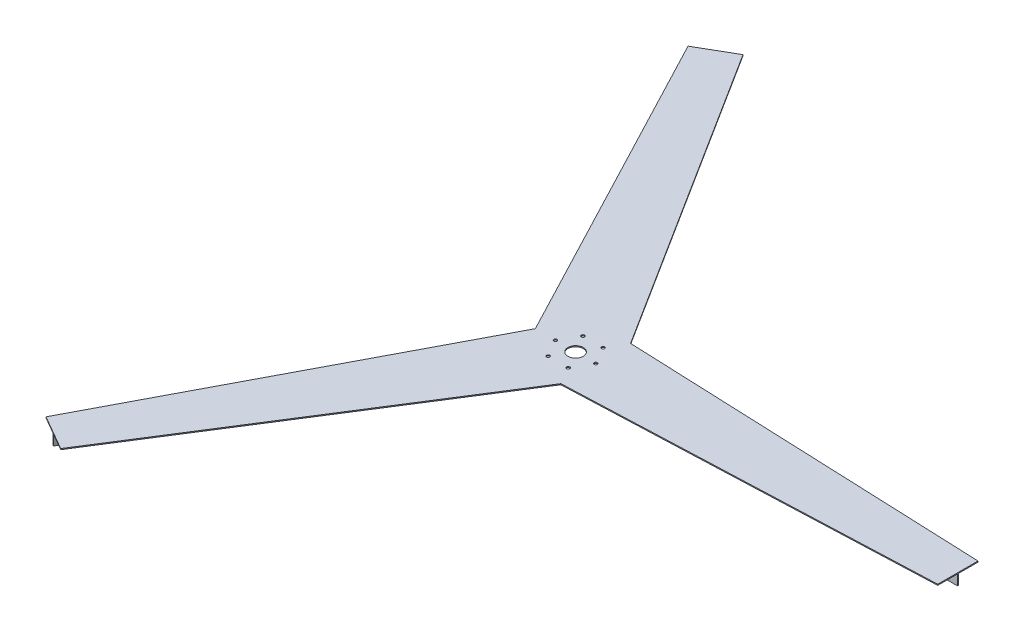
ISO-10303-21;
HEADER;
FILE_DESCRIPTION(('STEP AP214'),'2;1');
FILE_NAME('part.step','',(''),(''),'','','');
FILE_SCHEMA(('AUTOMOTIVE_DESIGN { 1 0 10303 214 1 1 1 1 }'));
ENDSEC;
DATA;
#1=APPLICATION_CONTEXT('core data for automotive mechanical design processes');
#2=APPLICATION_PROTOCOL_DEFINITION('international standard','automotive_design',2000,#1);
#3=PRODUCT_CONTEXT('',#1,'mechanical');
#4=PRODUCT('Part','Part','',(#3));
#5=PRODUCT_RELATED_PRODUCT_CATEGORY('part','',(#4));
#6=PRODUCT_DEFINITION_FORMATION('','',#4);
#7=PRODUCT_DEFINITION_CONTEXT('part definition',#1,'design');
#8=PRODUCT_DEFINITION('design','',#6,#7);
#9=PRODUCT_DEFINITION_SHAPE('','',#8);
#10=(LENGTH_UNIT() NAMED_UNIT(*) SI_UNIT(.MILLI.,.METRE.));
#11=(NAMED_UNIT(*) PLANE_ANGLE_UNIT() SI_UNIT($,.RADIAN.));
#12=(NAMED_UNIT(*) SI_UNIT($,.STERADIAN.) SOLID_ANGLE_UNIT());
#13=UNCERTAINTY_MEASURE_WITH_UNIT(LENGTH_MEASURE(1.E-05),#10,'distance_accuracy_value','');
#14=(GEOMETRIC_REPRESENTATION_CONTEXT(3) GLOBAL_UNCERTAINTY_ASSIGNED_CONTEXT((#13)) GLOBAL_UNIT_ASSIGNED_CONTEXT((#10,
#11,#12)) REPRESENTATION_CONTEXT('',''));
#15=CARTESIAN_POINT('',(0.,0.,0.));
#16=DIRECTION('',(0.,0.,1.));
#17=DIRECTION('',(1.,0.,0.));
#18=AXIS2_PLACEMENT_3D('',#15,#16,#17);
#19=CARTESIAN_POINT('',(0.,0.,0.));
#20=DIRECTION('',(0.,1.,0.));
#21=DIRECTION('',(0.,0.,1.));
#22=AXIS2_PLACEMENT_3D('',#19,#20,#21);
#23=PLANE('',#22);
#24=CARTESIAN_POINT('',(50.,0.,5.759281940243E-13));
#25=DIRECTION('',(0.,1.,0.));
#26=DIRECTION('',(0.,0.,1.));
#27=AXIS2_PLACEMENT_3D('',#24,#25,#26);
#28=CIRCLE('',#27,4.00000000000001);
#29=CARTESIAN_POINT('',(50.,0.,4.00000000000058));
#30=VERTEX_POINT('',#29);
#31=EDGE_CURVE('E217',#30,#30,#28,.T.);
#32=ORIENTED_EDGE('',*,*,#31,.T.);
#33=EDGE_LOOP('',(#32));
#34=FACE_BOUND('',#33,.T.);
#35=CARTESIAN_POINT('',(25.0000000000004,0.,-43.3012701892217));
#36=DIRECTION('',(0.,1.,0.));
#37=DIRECTION('',(0.,0.,1.));
#38=AXIS2_PLACEMENT_3D('',#35,#36,#37);
#39=CIRCLE('',#38,4.);
#40=CARTESIAN_POINT('',(25.0000000000004,0.,-39.3012701892217));
#41=VERTEX_POINT('',#40);
#42=EDGE_CURVE('E224',#41,#41,#39,.T.);
#43=ORIENTED_EDGE('',*,*,#42,.T.);
#44=EDGE_LOOP('',(#43));
#45=FACE_BOUND('',#44,.T.);
#46=CARTESIAN_POINT('',(-24.9999999999989,0.,-43.3012701892211));
#47=DIRECTION('',(0.,1.,0.));
#48=DIRECTION('',(0.,0.,1.));
#49=AXIS2_PLACEMENT_3D('',#46,#47,#48);
#50=CIRCLE('',#49,4.00000000000042);
#51=CARTESIAN_POINT('',(-24.9999999999989,0.,-39.3012701892206));
#52=VERTEX_POINT('',#51);
#53=EDGE_CURVE('E760',#52,#52,#50,.T.);
#54=ORIENTED_EDGE('',*,*,#53,.T.);
#55=EDGE_LOOP('',(#54));
#56=FACE_BOUND('',#55,.T.);
#57=CARTESIAN_POINT('',(-49.9999999999988,0.,2.84187880663881E-13));
#58=DIRECTION('',(0.,1.,0.));
#59=DIRECTION('',(0.,0.,1.));
#60=AXIS2_PLACEMENT_3D('',#57,#58,#59);
#61=CIRCLE('',#60,3.99999999999978);
#62=CARTESIAN_POINT('',(-49.9999999999988,0.,4.00000000000006));
#63=VERTEX_POINT('',#62);
#64=EDGE_CURVE('E756',#63,#63,#61,.T.);
#65=ORIENTED_EDGE('',*,*,#64,.T.);
#66=EDGE_LOOP('',(#65));
#67=FACE_BOUND('',#66,.T.);
#68=CARTESIAN_POINT('',(-25.0000000000001,0.,43.3012701892219));
#69=DIRECTION('',(0.,1.,0.));
#70=DIRECTION('',(0.,0.,1.));
#71=AXIS2_PLACEMENT_3D('',#68,#69,#70);
#72=CIRCLE('',#71,4.00000000000001);
#73=CARTESIAN_POINT('',(-25.0000000000001,0.,47.3012701892219));
#74=VERTEX_POINT('',#73);
#75=EDGE_CURVE('E752',#74,#74,#72,.T.);
#76=ORIENTED_EDGE('',*,*,#75,.T.);
#77=EDGE_LOOP('',(#76));
#78=FACE_BOUND('',#77,.T.);
#79=CARTESIAN_POINT('',(25.0000000000001,0.,43.301270189222));
#80=DIRECTION('',(0.,1.,0.));
#81=DIRECTION('',(0.,0.,1.));
#82=AXIS2_PLACEMENT_3D('',#79,#80,#81);
#83=CIRCLE('',#82,3.9999999999999);
#84=CARTESIAN_POINT('',(25.0000000000001,0.,47.3012701892219));
#85=VERTEX_POINT('',#84);
#86=EDGE_CURVE('E747',#85,#85,#83,.T.);
#87=ORIENTED_EDGE('',*,*,#86,.T.);
#88=EDGE_LOOP('',(#87));
#89=FACE_BOUND('',#88,.T.);
#90=CARTESIAN_POINT('',(0.,0.,0.));
#91=DIRECTION('',(0.,1.,0.));
#92=DIRECTION('',(0.,0.,1.));
#93=AXIS2_PLACEMENT_3D('',#90,#91,#92);
#94=CIRCLE('',#93,19.05);
#95=CARTESIAN_POINT('',(0.,0.,19.05));
#96=VERTEX_POINT('',#95);
#97=EDGE_CURVE('E331',#96,#96,#94,.T.);
#98=ORIENTED_EDGE('',*,*,#97,.T.);
#99=EDGE_LOOP('',(#98));
#100=FACE_BOUND('',#99,.T.);
#101=DIRECTION('',(0.500000000000016,0.,-0.86602540378443));
#102=VECTOR('',#101,1.);
#103=CARTESIAN_POINT('',(-476.08253175474,0.,822.099133595202));
#104=LINE('',#103,#102);
#105=CARTESIAN_POINT('',(-476.08253175474,0.,822.099133595202));
#106=VERTEX_POINT('',#105);
#107=CARTESIAN_POINT('',(-33.5825317547301,0.,55.6666512459888));
#108=VERTEX_POINT('',#107);
#109=EDGE_CURVE('E205',#106,#108,#104,.T.);
#110=ORIENTED_EDGE('',*,*,#109,.F.);
#111=DIRECTION('',(-0.866025403784438,0.,-0.5));
#112=VECTOR('',#111,1.);
#113=CARTESIAN_POINT('',(-475.,0.,822.724133595217));
#114=LINE('',#113,#112);
#115=CARTESIAN_POINT('',(-518.301270189225,0.,797.724133595215));
#116=VERTEX_POINT('',#115);
#117=EDGE_CURVE('E191',#106,#116,#114,.T.);
#118=ORIENTED_EDGE('',*,*,#117,.T.);
#119=DIRECTION('',(-0.464395291161132,0.,0.885628033401929));
#120=VECTOR('',#119,1.);
#121=CARTESIAN_POINT('',(-78.4337013547368,0.,-41.128148843215));
#122=LINE('',#121,#120);
#123=CARTESIAN_POINT('',(-100.,0.,-2.28983498828939E-13));
#124=VERTEX_POINT('',#123);
#125=EDGE_CURVE('E203',#124,#116,#122,.T.);
#126=ORIENTED_EDGE('',*,*,#125,.F.);
#127=DIRECTION('',(0.464395291161126,0.,0.885628033401932));
#128=VECTOR('',#127,1.);
#129=CARTESIAN_POINT('',(-78.4337013547372,0.,41.1281488432145));
#130=LINE('',#129,#128);
#131=CARTESIAN_POINT('',(-518.30127018922,0.,-797.724133595218));
#132=VERTEX_POINT('',#131);
#133=EDGE_CURVE('E377',#132,#124,#130,.T.);
#134=ORIENTED_EDGE('',*,*,#133,.F.);
#135=DIRECTION('',(0.866025403784439,0.,-0.5));
#136=VECTOR('',#135,1.);
#137=CARTESIAN_POINT('',(-475.,0.,-822.724133595217));
#138=LINE('',#137,#136);
#139=CARTESIAN_POINT('',(-476.082531754721,0.,-822.099133595222));
#140=VERTEX_POINT('',#139);
#141=EDGE_CURVE('E374',#132,#140,#138,.T.);
#142=ORIENTED_EDGE('',*,*,#141,.T.);
#143=DIRECTION('',(-0.499999999999985,0.,-0.866025403784448));
#144=VECTOR('',#143,1.);
#145=CARTESIAN_POINT('',(-33.582531754731,0.,-55.6666512459882));
#146=LINE('',#145,#144);
#147=CARTESIAN_POINT('',(-33.582531754731,0.,-55.6666512459882));
#148=VERTEX_POINT('',#147);
#149=EDGE_CURVE('E266',#148,#140,#146,.T.);
#150=ORIENTED_EDGE('',*,*,#149,.F.);
#151=DIRECTION('',(-0.866025403784437,0.,0.500000000000003));
#152=VECTOR('',#151,1.);
#153=CARTESIAN_POINT('',(-31.4174682452696,0.,-56.9166512459884));
#154=LINE('',#153,#152);
#155=CARTESIAN_POINT('',(-31.4174682452696,0.,-56.9166512459884));
#156=VERTEX_POINT('',#155);
#157=EDGE_CURVE('E270',#156,#148,#154,.T.);
#158=ORIENTED_EDGE('',*,*,#157,.F.);
#159=DIRECTION('',(0.499999999999985,0.,0.866025403784447));
#160=VECTOR('',#159,1.);
#161=CARTESIAN_POINT('',(-473.91746824526,0.,-823.349133595232));
#162=LINE('',#161,#160);
#163=CARTESIAN_POINT('',(-473.91746824526,0.,-823.349133595232));
#164=VERTEX_POINT('',#163);
#165=EDGE_CURVE('E275',#164,#156,#162,.T.);
#166=ORIENTED_EDGE('',*,*,#165,.F.);
#167=CARTESIAN_POINT('',(-431.698729810775,0.,-847.724133595218));
#168=VERTEX_POINT('',#167);
#169=EDGE_CURVE('E373',#164,#168,#138,.T.);
#170=ORIENTED_EDGE('',*,*,#169,.T.);
#171=DIRECTION('',(-0.534778729649158,0.,-0.844992136244376));
#172=VECTOR('',#171,1.);
#173=CARTESIAN_POINT('',(74.8348723862202,0.,-47.3615034644365));
#174=LINE('',#173,#172);
#175=CARTESIAN_POINT('',(50.0000000000002,0.,-86.6025403784437));
#176=VERTEX_POINT('',#175);
#177=EDGE_CURVE('E337',#176,#168,#174,.T.);
#178=ORIENTED_EDGE('',*,*,#177,.F.);
#179=DIRECTION('',(-0.999174020810289,0.,-0.04063589715756));
#180=VECTOR('',#179,1.);
#181=CARTESIAN_POINT('',(3.5988289685173,0.,-88.4896523076516));
#182=LINE('',#181,#180);
#183=CARTESIAN_POINT('',(950.,0.,-49.9999999999966));
#184=VERTEX_POINT('',#183);
#185=EDGE_CURVE('E396',#184,#176,#182,.T.);
#186=ORIENTED_EDGE('',*,*,#185,.F.);
#187=DIRECTION('',(0.,0.,1.));
#188=VECTOR('',#187,1.);
#189=CARTESIAN_POINT('',(950.,0.,0.));
#190=LINE('',#189,#188);
#191=CARTESIAN_POINT('',(950.,0.,-1.25000000000006));
#192=VERTEX_POINT('',#191);
#193=EDGE_CURVE('E393',#184,#192,#190,.T.);
#194=ORIENTED_EDGE('',*,*,#193,.T.);
#195=DIRECTION('',(1.,0.,0.));
#196=VECTOR('',#195,1.);
#197=CARTESIAN_POINT('',(64.9999999999999,0.,-1.25000000000027));
#198=LINE('',#197,#196);
#199=CARTESIAN_POINT('',(64.9999999999999,0.,-1.25000000000027));
#200=VERTEX_POINT('',#199);
#201=EDGE_CURVE('E296',#200,#192,#198,.T.);
#202=ORIENTED_EDGE('',*,*,#201,.F.);
#203=DIRECTION('',(0.,0.,-1.));
#204=VECTOR('',#203,1.);
#205=CARTESIAN_POINT('',(64.9999999999999,0.,1.25000000000005));
#206=LINE('',#205,#204);
#207=CARTESIAN_POINT('',(64.9999999999999,0.,1.25000000000005));
#208=VERTEX_POINT('',#207);
#209=EDGE_CURVE('E309',#208,#200,#206,.T.);
#210=ORIENTED_EDGE('',*,*,#209,.F.);
#211=DIRECTION('',(-1.,0.,0.));
#212=VECTOR('',#211,1.);
#213=CARTESIAN_POINT('',(950.,0.,1.25000000000017));
#214=LINE('',#213,#212);
#215=CARTESIAN_POINT('',(950.,0.,1.25000000000011));
#216=VERTEX_POINT('',#215);
#217=EDGE_CURVE('E279',#216,#208,#214,.T.);
#218=ORIENTED_EDGE('',*,*,#217,.F.);
#219=CARTESIAN_POINT('',(950.,0.,50.0000000000034));
#220=VERTEX_POINT('',#219);
#221=EDGE_CURVE('E392',#216,#220,#190,.T.);
#222=ORIENTED_EDGE('',*,*,#221,.T.);
#223=DIRECTION('',(0.99917402081029,0.,-0.0406358971575527));
#224=VECTOR('',#223,1.);
#225=CARTESIAN_POINT('',(3.59882896851664,0.,88.4896523076515));
#226=LINE('',#225,#224);
#227=CARTESIAN_POINT('',(49.9999999999998,0.,86.602540378444));
#228=VERTEX_POINT('',#227);
#229=EDGE_CURVE('E388',#228,#220,#226,.T.);
#230=ORIENTED_EDGE('',*,*,#229,.F.);
#231=DIRECTION('',(0.534778729649163,0.,-0.844992136244372));
#232=VECTOR('',#231,1.);
#233=CARTESIAN_POINT('',(74.8348723862199,0.,47.3615034644371));
#234=LINE('',#233,#232);
#235=CARTESIAN_POINT('',(-431.698729810781,0.,847.724133595215));
#236=VERTEX_POINT('',#235);
#237=EDGE_CURVE('E384',#236,#228,#234,.T.);
#238=ORIENTED_EDGE('',*,*,#237,.F.);
#239=CARTESIAN_POINT('',(-473.917468245296,0.,823.349133595202));
#240=VERTEX_POINT('',#239);
#241=EDGE_CURVE('E202',#236,#240,#114,.T.);
#242=ORIENTED_EDGE('',*,*,#241,.T.);
#243=DIRECTION('',(-0.500000000000016,0.,0.866025403784429));
#244=VECTOR('',#243,1.);
#245=CARTESIAN_POINT('',(-31.4174682452687,0.,56.9166512459889));
#246=LINE('',#245,#244);
#247=CARTESIAN_POINT('',(-31.4174682452687,0.,56.9166512459889));
#248=VERTEX_POINT('',#247);
#249=EDGE_CURVE('E70',#248,#240,#246,.T.);
#250=ORIENTED_EDGE('',*,*,#249,.F.);
#251=DIRECTION('',(0.866025403784444,0.,0.499999999999991));
#252=VECTOR('',#251,1.);
#253=CARTESIAN_POINT('',(-33.5825317547301,0.,55.6666512459887));
#254=LINE('',#253,#252);
#255=EDGE_CURVE('E65',#108,#248,#254,.T.);
#256=ORIENTED_EDGE('',*,*,#255,.F.);
#257=EDGE_LOOP('',(#110,#118,#126,#134,#142,#150,#158,#166,#170,#178,#186,#194,#202,#210,#218,
#222,#230,#238,#242,#250,#256));
#258=FACE_BOUND('',#257,.T.);
#259=ADVANCED_FACE('F49',(#34,#45,#56,#67,#78,#89,#100,#258),#23,.F.);
#260=CARTESIAN_POINT('',(-475.,2.5,-822.724133595217));
#261=DIRECTION('',(-0.5,0.,-0.866025403784439));
#262=DIRECTION('',(-0.866025403784439,0.,0.5));
#263=AXIS2_PLACEMENT_3D('',#260,#261,#262);
#264=PLANE('',#263);
#265=ORIENTED_EDGE('',*,*,#141,.F.);
#266=DIRECTION('',(0.,-1.,0.));
#267=VECTOR('',#266,1.);
#268=CARTESIAN_POINT('',(-518.30127018922,2.5,-797.724133595218));
#269=LINE('',#268,#267);
#270=CARTESIAN_POINT('',(-518.30127018922,2.5,-797.724133595218));
#271=VERTEX_POINT('',#270);
#272=EDGE_CURVE('E11',#271,#132,#269,.T.);
#273=ORIENTED_EDGE('',*,*,#272,.F.);
#274=DIRECTION('',(0.866025403784439,0.,-0.5));
#275=VECTOR('',#274,1.);
#276=CARTESIAN_POINT('',(-475.,2.5,-822.724133595217));
#277=LINE('',#276,#275);
#278=CARTESIAN_POINT('',(-431.698729810775,2.5,-847.724133595218));
#279=VERTEX_POINT('',#278);
#280=EDGE_CURVE('E336',#271,#279,#277,.T.);
#281=ORIENTED_EDGE('',*,*,#280,.T.);
#282=DIRECTION('',(0.,-1.,0.));
#283=VECTOR('',#282,1.);
#284=CARTESIAN_POINT('',(-431.698729810775,2.5,-847.724133595218));
#285=LINE('',#284,#283);
#286=EDGE_CURVE('E369',#279,#168,#285,.T.);
#287=ORIENTED_EDGE('',*,*,#286,.T.);
#288=ORIENTED_EDGE('',*,*,#169,.F.);
#289=DIRECTION('',(0.,1.,0.));
#290=VECTOR('',#289,1.);
#291=CARTESIAN_POINT('',(-473.91746824526,-25.4,-823.349133595232));
#292=LINE('',#291,#290);
#293=CARTESIAN_POINT('',(-473.91746824526,-25.4,-823.349133595232));
#294=VERTEX_POINT('',#293);
#295=EDGE_CURVE('E210',#294,#164,#292,.T.);
#296=ORIENTED_EDGE('',*,*,#295,.F.);
#297=DIRECTION('',(0.866025403784444,0.,-0.49999999999999));
#298=VECTOR('',#297,1.);
#299=CARTESIAN_POINT('',(-476.082531754721,-25.4,-822.099133595232));
#300=LINE('',#299,#298);
#301=CARTESIAN_POINT('',(-476.082531754721,-25.4,-822.099133595232));
#302=VERTEX_POINT('',#301);
#303=EDGE_CURVE('E271',#302,#294,#300,.T.);
#304=ORIENTED_EDGE('',*,*,#303,.F.);
#305=DIRECTION('',(0.,1.,0.));
#306=VECTOR('',#305,1.);
#307=CARTESIAN_POINT('',(-476.082531754721,-25.4,-822.099133595232));
#308=LINE('',#307,#306);
#309=EDGE_CURVE('E261',#302,#140,#308,.T.);
#310=ORIENTED_EDGE('',*,*,#309,.T.);
#311=EDGE_LOOP('',(#265,#273,#281,#287,#288,#296,#304,#310));
#312=FACE_BOUND('',#311,.T.);
#313=ADVANCED_FACE('F436',(#312),#264,.T.);
#314=CARTESIAN_POINT('',(-78.4337013547372,2.5,41.1281488432145));
#315=DIRECTION('',(0.885628033401932,0.,-0.464395291161126));
#316=DIRECTION('',(-0.464395291161126,0.,-0.885628033401932));
#317=AXIS2_PLACEMENT_3D('',#314,#315,#316);
#318=PLANE('',#317);
#319=ORIENTED_EDGE('',*,*,#133,.T.);
#320=DIRECTION('',(0.,-1.,0.));
#321=VECTOR('',#320,1.);
#322=CARTESIAN_POINT('',(-100.,2.5,-2.28983498828939E-13));
#323=LINE('',#322,#321);
#324=CARTESIAN_POINT('',(-100.,2.5,-2.28983498828939E-13));
#325=VERTEX_POINT('',#324);
#326=EDGE_CURVE('E58',#325,#124,#323,.T.);
#327=ORIENTED_EDGE('',*,*,#326,.F.);
#328=DIRECTION('',(0.464395291161126,0.,0.885628033401932));
#329=VECTOR('',#328,1.);
#330=CARTESIAN_POINT('',(-78.4337013547372,2.5,41.1281488432145));
#331=LINE('',#330,#329);
#332=EDGE_CURVE('E341',#271,#325,#331,.T.);
#333=ORIENTED_EDGE('',*,*,#332,.F.);
#334=ORIENTED_EDGE('',*,*,#272,.T.);
#335=EDGE_LOOP('',(#319,#327,#333,#334));
#336=FACE_BOUND('',#335,.T.);
#337=ADVANCED_FACE('F433',(#336),#318,.F.);
#338=CARTESIAN_POINT('',(-78.4337013547368,2.5,-41.128148843215));
#339=DIRECTION('',(0.885628033401929,0.,0.464395291161132));
#340=DIRECTION('',(0.464395291161132,0.,-0.885628033401929));
#341=AXIS2_PLACEMENT_3D('',#338,#339,#340);
#342=PLANE('',#341);
#343=ORIENTED_EDGE('',*,*,#125,.T.);
#344=DIRECTION('',(0.,-1.,0.));
#345=VECTOR('',#344,1.);
#346=CARTESIAN_POINT('',(-518.301270189225,2.5,797.724133595215));
#347=LINE('',#346,#345);
#348=CARTESIAN_POINT('',(-518.301270189225,2.5,797.724133595215));
#349=VERTEX_POINT('',#348);
#350=EDGE_CURVE('E199',#349,#116,#347,.T.);
#351=ORIENTED_EDGE('',*,*,#350,.F.);
#352=DIRECTION('',(-0.464395291161132,0.,0.885628033401929));
#353=VECTOR('',#352,1.);
#354=CARTESIAN_POINT('',(-78.4337013547368,2.5,-41.128148843215));
#355=LINE('',#354,#353);
#356=EDGE_CURVE('E345',#325,#349,#355,.T.);
#357=ORIENTED_EDGE('',*,*,#356,.F.);
#358=ORIENTED_EDGE('',*,*,#326,.T.);
#359=EDGE_LOOP('',(#343,#351,#357,#358));
#360=FACE_BOUND('',#359,.T.);
#361=ADVANCED_FACE('F429',(#360),#342,.F.);
#362=CARTESIAN_POINT('',(-475.,2.5,822.724133595217));
#363=DIRECTION('',(-0.5,0.,0.866025403784438));
#364=DIRECTION('',(0.866025403784438,0.,0.5));
#365=AXIS2_PLACEMENT_3D('',#362,#363,#364);
#366=PLANE('',#365);
#367=ORIENTED_EDGE('',*,*,#241,.F.);
#368=DIRECTION('',(0.,-1.,0.));
#369=VECTOR('',#368,1.);
#370=CARTESIAN_POINT('',(-431.698729810781,2.5,847.724133595215));
#371=LINE('',#370,#369);
#372=CARTESIAN_POINT('',(-431.698729810781,2.5,847.724133595215));
#373=VERTEX_POINT('',#372);
#374=EDGE_CURVE('E421',#373,#236,#371,.T.);
#375=ORIENTED_EDGE('',*,*,#374,.F.);
#376=DIRECTION('',(-0.866025403784438,0.,-0.5));
#377=VECTOR('',#376,1.);
#378=CARTESIAN_POINT('',(-475.,2.5,822.724133595217));
#379=LINE('',#378,#377);
#380=EDGE_CURVE('E348',#373,#349,#379,.T.);
#381=ORIENTED_EDGE('',*,*,#380,.T.);
#382=ORIENTED_EDGE('',*,*,#350,.T.);
#383=ORIENTED_EDGE('',*,*,#117,.F.);
#384=DIRECTION('',(0.,1.,0.));
#385=VECTOR('',#384,1.);
#386=CARTESIAN_POINT('',(-476.08253175474,-25.4,822.099133595202));
#387=LINE('',#386,#385);
#388=CARTESIAN_POINT('',(-476.08253175474,-25.4,822.099133595202));
#389=VERTEX_POINT('',#388);
#390=EDGE_CURVE('E196',#389,#106,#387,.T.);
#391=ORIENTED_EDGE('',*,*,#390,.F.);
#392=DIRECTION('',(-0.866025403784444,0.,-0.49999999999999));
#393=VECTOR('',#392,1.);
#394=CARTESIAN_POINT('',(-473.917468245278,-25.4,823.349133595202));
#395=LINE('',#394,#393);
#396=CARTESIAN_POINT('',(-473.917468245278,-25.4,823.349133595202));
#397=VERTEX_POINT('',#396);
#398=EDGE_CURVE('E238',#397,#389,#395,.T.);
#399=ORIENTED_EDGE('',*,*,#398,.F.);
#400=DIRECTION('',(0.,1.,0.));
#401=VECTOR('',#400,1.);
#402=CARTESIAN_POINT('',(-473.917468245278,-25.4,823.349133595202));
#403=LINE('',#402,#401);
#404=EDGE_CURVE('E231',#397,#240,#403,.T.);
#405=ORIENTED_EDGE('',*,*,#404,.T.);
#406=EDGE_LOOP('',(#367,#375,#381,#382,#383,#391,#399,#405));
#407=FACE_BOUND('',#406,.T.);
#408=ADVANCED_FACE('F193',(#407),#366,.T.);
#409=CARTESIAN_POINT('',(74.8348723862199,2.5,47.3615034644371));
#410=DIRECTION('',(-0.844992136244372,0.,-0.534778729649163));
#411=DIRECTION('',(-0.534778729649163,0.,0.844992136244372));
#412=AXIS2_PLACEMENT_3D('',#409,#410,#411);
#413=PLANE('',#412);
#414=ORIENTED_EDGE('',*,*,#237,.T.);
#415=DIRECTION('',(0.,-1.,0.));
#416=VECTOR('',#415,1.);
#417=CARTESIAN_POINT('',(49.9999999999998,2.5,86.602540378444));
#418=LINE('',#417,#416);
#419=CARTESIAN_POINT('',(49.9999999999998,2.5,86.602540378444));
#420=VERTEX_POINT('',#419);
#421=EDGE_CURVE('E417',#420,#228,#418,.T.);
#422=ORIENTED_EDGE('',*,*,#421,.F.);
#423=DIRECTION('',(0.534778729649163,0.,-0.844992136244372));
#424=VECTOR('',#423,1.);
#425=CARTESIAN_POINT('',(74.8348723862199,2.5,47.3615034644371));
#426=LINE('',#425,#424);
#427=EDGE_CURVE('E351',#373,#420,#426,.T.);
#428=ORIENTED_EDGE('',*,*,#427,.F.);
#429=ORIENTED_EDGE('',*,*,#374,.T.);
#430=EDGE_LOOP('',(#414,#422,#428,#429));
#431=FACE_BOUND('',#430,.T.);
#432=ADVANCED_FACE('F529',(#431),#413,.F.);
#433=CARTESIAN_POINT('',(3.59882896851664,2.5,88.4896523076515));
#434=DIRECTION('',(-0.0406358971575527,0.,-0.999174020810289));
#435=DIRECTION('',(-0.999174020810289,0.,0.0406358971575527));
#436=AXIS2_PLACEMENT_3D('',#433,#434,#435);
#437=PLANE('',#436);
#438=ORIENTED_EDGE('',*,*,#229,.T.);
#439=DIRECTION('',(0.,-1.,0.));
#440=VECTOR('',#439,1.);
#441=CARTESIAN_POINT('',(950.,2.5,50.0000000000034));
#442=LINE('',#441,#440);
#443=CARTESIAN_POINT('',(950.,2.5,50.0000000000034));
#444=VERTEX_POINT('',#443);
#445=EDGE_CURVE('E413',#444,#220,#442,.T.);
#446=ORIENTED_EDGE('',*,*,#445,.F.);
#447=DIRECTION('',(0.99917402081029,0.,-0.0406358971575527));
#448=VECTOR('',#447,1.);
#449=CARTESIAN_POINT('',(3.59882896851664,2.5,88.4896523076515));
#450=LINE('',#449,#448);
#451=EDGE_CURVE('E355',#420,#444,#450,.T.);
#452=ORIENTED_EDGE('',*,*,#451,.F.);
#453=ORIENTED_EDGE('',*,*,#421,.T.);
#454=EDGE_LOOP('',(#438,#446,#452,#453));
#455=FACE_BOUND('',#454,.T.);
#456=ADVANCED_FACE('F482',(#455),#437,.F.);
#457=CARTESIAN_POINT('',(950.,2.5,0.));
#458=DIRECTION('',(1.,0.,0.));
#459=DIRECTION('',(0.,0.,-1.));
#460=AXIS2_PLACEMENT_3D('',#457,#458,#459);
#461=PLANE('',#460);
#462=ORIENTED_EDGE('',*,*,#193,.F.);
#463=DIRECTION('',(0.,-1.,0.));
#464=VECTOR('',#463,1.);
#465=CARTESIAN_POINT('',(950.,2.5,-49.9999999999966));
#466=LINE('',#465,#464);
#467=CARTESIAN_POINT('',(950.,2.5,-49.9999999999966));
#468=VERTEX_POINT('',#467);
#469=EDGE_CURVE('E410',#468,#184,#466,.T.);
#470=ORIENTED_EDGE('',*,*,#469,.F.);
#471=DIRECTION('',(0.,0.,1.));
#472=VECTOR('',#471,1.);
#473=CARTESIAN_POINT('',(950.,2.5,0.));
#474=LINE('',#473,#472);
#475=EDGE_CURVE('E358',#468,#444,#474,.T.);
#476=ORIENTED_EDGE('',*,*,#475,.T.);
#477=ORIENTED_EDGE('',*,*,#445,.T.);
#478=ORIENTED_EDGE('',*,*,#221,.F.);
#479=DIRECTION('',(0.,1.,0.));
#480=VECTOR('',#479,1.);
#481=CARTESIAN_POINT('',(950.,-25.4,1.25000000000017));
#482=LINE('',#481,#480);
#483=CARTESIAN_POINT('',(950.,-25.4,1.25000000000017));
#484=VERTEX_POINT('',#483);
#485=EDGE_CURVE('E327',#484,#216,#482,.T.);
#486=ORIENTED_EDGE('',*,*,#485,.F.);
#487=DIRECTION('',(0.,0.,1.));
#488=VECTOR('',#487,1.);
#489=CARTESIAN_POINT('',(950.,-25.4,-1.24999999999984));
#490=LINE('',#489,#488);
#491=CARTESIAN_POINT('',(950.,-25.4,-1.24999999999984));
#492=VERTEX_POINT('',#491);
#493=EDGE_CURVE('E291',#492,#484,#490,.T.);
#494=ORIENTED_EDGE('',*,*,#493,.F.);
#495=DIRECTION('',(0.,1.,0.));
#496=VECTOR('',#495,1.);
#497=CARTESIAN_POINT('',(950.,-25.4,-1.24999999999984));
#498=LINE('',#497,#496);
#499=EDGE_CURVE('E305',#492,#192,#498,.T.);
#500=ORIENTED_EDGE('',*,*,#499,.T.);
#501=EDGE_LOOP('',(#462,#470,#476,#477,#478,#486,#494,#500));
#502=FACE_BOUND('',#501,.T.);
#503=ADVANCED_FACE('F463',(#502),#461,.T.);
#504=CARTESIAN_POINT('',(3.5988289685173,2.5,-88.4896523076516));
#505=DIRECTION('',(-0.04063589715756,0.,0.999174020810289));
#506=DIRECTION('',(0.999174020810289,0.,0.04063589715756));
#507=AXIS2_PLACEMENT_3D('',#504,#505,#506);
#508=PLANE('',#507);
#509=ORIENTED_EDGE('',*,*,#185,.T.);
#510=DIRECTION('',(0.,-1.,0.));
#511=VECTOR('',#510,1.);
#512=CARTESIAN_POINT('',(50.0000000000002,2.5,-86.6025403784437));
#513=LINE('',#512,#511);
#514=CARTESIAN_POINT('',(50.0000000000002,2.5,-86.6025403784437));
#515=VERTEX_POINT('',#514);
#516=EDGE_CURVE('E406',#515,#176,#513,.T.);
#517=ORIENTED_EDGE('',*,*,#516,.F.);
#518=DIRECTION('',(-0.999174020810289,0.,-0.04063589715756));
#519=VECTOR('',#518,1.);
#520=CARTESIAN_POINT('',(3.5988289685173,2.5,-88.4896523076516));
#521=LINE('',#520,#519);
#522=EDGE_CURVE('E362',#468,#515,#521,.T.);
#523=ORIENTED_EDGE('',*,*,#522,.F.);
#524=ORIENTED_EDGE('',*,*,#469,.T.);
#525=EDGE_LOOP('',(#509,#517,#523,#524));
#526=FACE_BOUND('',#525,.T.);
#527=ADVANCED_FACE('F460',(#526),#508,.F.);
#528=CARTESIAN_POINT('',(0.,2.5,0.));
#529=DIRECTION('',(0.,-1.,0.));
#530=DIRECTION('',(0.,0.,-1.));
#531=AXIS2_PLACEMENT_3D('',#528,#529,#530);
#532=CYLINDRICAL_SURFACE('',#531,19.05);
#533=CARTESIAN_POINT('',(0.,2.5,0.));
#534=DIRECTION('',(0.,1.,0.));
#535=DIRECTION('',(0.,0.,1.));
#536=AXIS2_PLACEMENT_3D('',#533,#534,#535);
#537=CIRCLE('',#536,19.05);
#538=CARTESIAN_POINT('',(0.,2.5,19.05));
#539=VERTEX_POINT('',#538);
#540=EDGE_CURVE('E332',#539,#539,#537,.T.);
#541=ORIENTED_EDGE('',*,*,#540,.T.);
#542=EDGE_LOOP('',(#541));
#543=FACE_BOUND('',#542,.T.);
#544=ORIENTED_EDGE('',*,*,#97,.F.);
#545=EDGE_LOOP('',(#544));
#546=FACE_BOUND('',#545,.T.);
#547=ADVANCED_FACE('F51',(#543,#546),#532,.F.);
#548=CARTESIAN_POINT('',(74.8348723862202,2.5,-47.3615034644365));
#549=DIRECTION('',(-0.844992136244376,0.,0.534778729649158));
#550=DIRECTION('',(0.534778729649158,0.,0.844992136244376));
#551=AXIS2_PLACEMENT_3D('',#548,#549,#550);
#552=PLANE('',#551);
#553=ORIENTED_EDGE('',*,*,#177,.T.);
#554=ORIENTED_EDGE('',*,*,#286,.F.);
#555=DIRECTION('',(-0.534778729649158,0.,-0.844992136244376));
#556=VECTOR('',#555,1.);
#557=CARTESIAN_POINT('',(74.8348723862202,2.5,-47.3615034644365));
#558=LINE('',#557,#556);
#559=EDGE_CURVE('E366',#515,#279,#558,.T.);
#560=ORIENTED_EDGE('',*,*,#559,.F.);
#561=ORIENTED_EDGE('',*,*,#516,.T.);
#562=EDGE_LOOP('',(#553,#554,#560,#561));
#563=FACE_BOUND('',#562,.T.);
#564=ADVANCED_FACE('F456',(#563),#552,.F.);
#565=CARTESIAN_POINT('',(0.,2.5,0.));
#566=DIRECTION('',(0.,1.,0.));
#567=DIRECTION('',(0.,0.,1.));
#568=AXIS2_PLACEMENT_3D('',#565,#566,#567);
#569=PLANE('',#568);
#570=CARTESIAN_POINT('',(50.,2.5,5.759281940243E-13));
#571=DIRECTION('',(0.,1.,0.));
#572=DIRECTION('',(0.,0.,1.));
#573=AXIS2_PLACEMENT_3D('',#570,#571,#572);
#574=CIRCLE('',#573,4.00000000000001);
#575=CARTESIAN_POINT('',(50.,2.5,4.00000000000058));
#576=VERTEX_POINT('',#575);
#577=EDGE_CURVE('E731',#576,#576,#574,.T.);
#578=ORIENTED_EDGE('',*,*,#577,.F.);
#579=EDGE_LOOP('',(#578));
#580=FACE_BOUND('',#579,.T.);
#581=CARTESIAN_POINT('',(25.0000000000004,2.5,-43.3012701892217));
#582=DIRECTION('',(0.,1.,0.));
#583=DIRECTION('',(0.,0.,1.));
#584=AXIS2_PLACEMENT_3D('',#581,#582,#583);
#585=CIRCLE('',#584,4.);
#586=CARTESIAN_POINT('',(25.0000000000004,2.5,-39.3012701892217));
#587=VERTEX_POINT('',#586);
#588=EDGE_CURVE('E735',#587,#587,#585,.T.);
#589=ORIENTED_EDGE('',*,*,#588,.F.);
#590=EDGE_LOOP('',(#589));
#591=FACE_BOUND('',#590,.T.);
#592=CARTESIAN_POINT('',(-24.9999999999989,2.5,-43.3012701892211));
#593=DIRECTION('',(0.,1.,0.));
#594=DIRECTION('',(0.,0.,1.));
#595=AXIS2_PLACEMENT_3D('',#592,#593,#594);
#596=CIRCLE('',#595,4.00000000000042);
#597=CARTESIAN_POINT('',(-24.9999999999989,2.5,-39.3012701892206));
#598=VERTEX_POINT('',#597);
#599=EDGE_CURVE('E739',#598,#598,#596,.T.);
#600=ORIENTED_EDGE('',*,*,#599,.F.);
#601=EDGE_LOOP('',(#600));
#602=FACE_BOUND('',#601,.T.);
#603=CARTESIAN_POINT('',(-49.9999999999988,2.5,2.84187880663881E-13));
#604=DIRECTION('',(0.,1.,0.));
#605=DIRECTION('',(0.,0.,1.));
#606=AXIS2_PLACEMENT_3D('',#603,#604,#605);
#607=CIRCLE('',#606,3.99999999999978);
#608=CARTESIAN_POINT('',(-49.9999999999988,2.5,4.00000000000006));
#609=VERTEX_POINT('',#608);
#610=EDGE_CURVE('E785',#609,#609,#607,.T.);
#611=ORIENTED_EDGE('',*,*,#610,.F.);
#612=EDGE_LOOP('',(#611));
#613=FACE_BOUND('',#612,.T.);
#614=CARTESIAN_POINT('',(-25.0000000000001,2.5,43.3012701892219));
#615=DIRECTION('',(0.,1.,0.));
#616=DIRECTION('',(0.,0.,1.));
#617=AXIS2_PLACEMENT_3D('',#614,#615,#616);
#618=CIRCLE('',#617,4.00000000000001);
#619=CARTESIAN_POINT('',(-25.0000000000001,2.5,47.3012701892219));
#620=VERTEX_POINT('',#619);
#621=EDGE_CURVE('E748',#620,#620,#618,.T.);
#622=ORIENTED_EDGE('',*,*,#621,.F.);
#623=EDGE_LOOP('',(#622));
#624=FACE_BOUND('',#623,.T.);
#625=CARTESIAN_POINT('',(25.0000000000001,2.5,43.301270189222));
#626=DIRECTION('',(0.,1.,0.));
#627=DIRECTION('',(0.,0.,1.));
#628=AXIS2_PLACEMENT_3D('',#625,#626,#627);
#629=CIRCLE('',#628,3.9999999999999);
#630=CARTESIAN_POINT('',(25.0000000000001,2.5,47.3012701892219));
#631=VERTEX_POINT('',#630);
#632=EDGE_CURVE('E743',#631,#631,#629,.T.);
#633=ORIENTED_EDGE('',*,*,#632,.F.);
#634=EDGE_LOOP('',(#633));
#635=FACE_BOUND('',#634,.T.);
#636=ORIENTED_EDGE('',*,*,#540,.F.);
#637=EDGE_LOOP('',(#636));
#638=FACE_BOUND('',#637,.T.);
#639=ORIENTED_EDGE('',*,*,#280,.F.);
#640=ORIENTED_EDGE('',*,*,#332,.T.);
#641=ORIENTED_EDGE('',*,*,#356,.T.);
#642=ORIENTED_EDGE('',*,*,#380,.F.);
#643=ORIENTED_EDGE('',*,*,#427,.T.);
#644=ORIENTED_EDGE('',*,*,#451,.T.);
#645=ORIENTED_EDGE('',*,*,#475,.F.);
#646=ORIENTED_EDGE('',*,*,#522,.T.);
#647=ORIENTED_EDGE('',*,*,#559,.T.);
#648=EDGE_LOOP('',(#639,#640,#641,#642,#643,#644,#645,#646,#647));
#649=FACE_BOUND('',#648,.T.);
#650=ADVANCED_FACE('F519',(#580,#591,#602,#613,#624,#635,#638,#649),#569,.T.);
#651=CARTESIAN_POINT('',(950.,-25.4,1.25000000000017));
#652=DIRECTION('',(0.,0.,-1.));
#653=DIRECTION('',(-1.,0.,0.));
#654=AXIS2_PLACEMENT_3D('',#651,#652,#653);
#655=PLANE('',#654);
#656=ORIENTED_EDGE('',*,*,#217,.T.);
#657=DIRECTION('',(0.,1.,0.));
#658=VECTOR('',#657,1.);
#659=CARTESIAN_POINT('',(64.9999999999999,-25.4,1.25000000000005));
#660=LINE('',#659,#658);
#661=CARTESIAN_POINT('',(64.9999999999999,-25.4,1.25000000000005));
#662=VERTEX_POINT('',#661);
#663=EDGE_CURVE('E323',#662,#208,#660,.T.);
#664=ORIENTED_EDGE('',*,*,#663,.F.);
#665=DIRECTION('',(-1.,0.,0.));
#666=VECTOR('',#665,1.);
#667=CARTESIAN_POINT('',(950.,-25.4,1.25000000000017));
#668=LINE('',#667,#666);
#669=EDGE_CURVE('E295',#484,#662,#668,.T.);
#670=ORIENTED_EDGE('',*,*,#669,.F.);
#671=ORIENTED_EDGE('',*,*,#485,.T.);
#672=EDGE_LOOP('',(#656,#664,#670,#671));
#673=FACE_BOUND('',#672,.T.);
#674=ADVANCED_FACE('F476',(#673),#655,.F.);
#675=CARTESIAN_POINT('',(64.9999999999999,-25.4,1.25000000000005));
#676=DIRECTION('',(1.,0.,0.));
#677=DIRECTION('',(0.,0.,-1.));
#678=AXIS2_PLACEMENT_3D('',#675,#676,#677);
#679=PLANE('',#678);
#680=ORIENTED_EDGE('',*,*,#209,.T.);
#681=DIRECTION('',(0.,1.,0.));
#682=VECTOR('',#681,1.);
#683=CARTESIAN_POINT('',(64.9999999999999,-25.4,-1.25000000000027));
#684=LINE('',#683,#682);
#685=CARTESIAN_POINT('',(64.9999999999999,-25.4,-1.25000000000027));
#686=VERTEX_POINT('',#685);
#687=EDGE_CURVE('E319',#686,#200,#684,.T.);
#688=ORIENTED_EDGE('',*,*,#687,.F.);
#689=DIRECTION('',(0.,0.,-1.));
#690=VECTOR('',#689,1.);
#691=CARTESIAN_POINT('',(64.9999999999999,-25.4,1.25000000000005));
#692=LINE('',#691,#690);
#693=EDGE_CURVE('E299',#662,#686,#692,.T.);
#694=ORIENTED_EDGE('',*,*,#693,.F.);
#695=ORIENTED_EDGE('',*,*,#663,.T.);
#696=EDGE_LOOP('',(#680,#688,#694,#695));
#697=FACE_BOUND('',#696,.T.);
#698=ADVANCED_FACE('F472',(#697),#679,.F.);
#699=CARTESIAN_POINT('',(64.9999999999999,-25.4,-1.25000000000027));
#700=DIRECTION('',(0.,0.,1.));
#701=DIRECTION('',(1.,0.,0.));
#702=AXIS2_PLACEMENT_3D('',#699,#700,#701);
#703=PLANE('',#702);
#704=ORIENTED_EDGE('',*,*,#201,.T.);
#705=ORIENTED_EDGE('',*,*,#499,.F.);
#706=DIRECTION('',(1.,0.,0.));
#707=VECTOR('',#706,1.);
#708=CARTESIAN_POINT('',(64.9999999999999,-25.4,-1.25000000000027));
#709=LINE('',#708,#707);
#710=EDGE_CURVE('E302',#686,#492,#709,.T.);
#711=ORIENTED_EDGE('',*,*,#710,.F.);
#712=ORIENTED_EDGE('',*,*,#687,.T.);
#713=EDGE_LOOP('',(#704,#705,#711,#712));
#714=FACE_BOUND('',#713,.T.);
#715=ADVANCED_FACE('F469',(#714),#703,.F.);
#716=CARTESIAN_POINT('',(0.,-25.4,0.));
#717=DIRECTION('',(0.,-1.,0.));
#718=DIRECTION('',(0.,0.,-1.));
#719=AXIS2_PLACEMENT_3D('',#716,#717,#718);
#720=PLANE('',#719);
#721=ORIENTED_EDGE('',*,*,#493,.T.);
#722=ORIENTED_EDGE('',*,*,#669,.T.);
#723=ORIENTED_EDGE('',*,*,#693,.T.);
#724=ORIENTED_EDGE('',*,*,#710,.T.);
#725=EDGE_LOOP('',(#721,#722,#723,#724));
#726=FACE_BOUND('',#725,.T.);
#727=ADVANCED_FACE('F608',(#726),#720,.T.);
#728=CARTESIAN_POINT('',(-473.91746824526,-25.4,-823.349133595232));
#729=DIRECTION('',(-0.866025403784447,0.,0.499999999999985));
#730=DIRECTION('',(0.499999999999985,0.,0.866025403784447));
#731=AXIS2_PLACEMENT_3D('',#728,#729,#730);
#732=PLANE('',#731);
#733=ORIENTED_EDGE('',*,*,#165,.T.);
#734=DIRECTION('',(0.,1.,0.));
#735=VECTOR('',#734,1.);
#736=CARTESIAN_POINT('',(-31.4174682452696,-25.4,-56.9166512459884));
#737=LINE('',#736,#735);
#738=CARTESIAN_POINT('',(-31.4174682452696,-25.4,-56.9166512459884));
#739=VERTEX_POINT('',#738);
#740=EDGE_CURVE('E253',#739,#156,#737,.T.);
#741=ORIENTED_EDGE('',*,*,#740,.F.);
#742=DIRECTION('',(0.499999999999985,0.,0.866025403784447));
#743=VECTOR('',#742,1.);
#744=CARTESIAN_POINT('',(-473.91746824526,-25.4,-823.349133595232));
#745=LINE('',#744,#743);
#746=EDGE_CURVE('E285',#294,#739,#745,.T.);
#747=ORIENTED_EDGE('',*,*,#746,.F.);
#748=ORIENTED_EDGE('',*,*,#295,.T.);
#749=EDGE_LOOP('',(#733,#741,#747,#748));
#750=FACE_BOUND('',#749,.T.);
#751=ADVANCED_FACE('F450',(#750),#732,.F.);
#752=CARTESIAN_POINT('',(-31.4174682452696,-25.4,-56.9166512459884));
#753=DIRECTION('',(-0.500000000000003,0.,-0.866025403784437));
#754=DIRECTION('',(-0.866025403784437,0.,0.500000000000003));
#755=AXIS2_PLACEMENT_3D('',#752,#753,#754);
#756=PLANE('',#755);
#757=ORIENTED_EDGE('',*,*,#157,.T.);
#758=DIRECTION('',(0.,1.,0.));
#759=VECTOR('',#758,1.);
#760=CARTESIAN_POINT('',(-33.582531754731,-25.4,-55.6666512459882));
#761=LINE('',#760,#759);
#762=CARTESIAN_POINT('',(-33.582531754731,-25.4,-55.6666512459882));
#763=VERTEX_POINT('',#762);
#764=EDGE_CURVE('E257',#763,#148,#761,.T.);
#765=ORIENTED_EDGE('',*,*,#764,.F.);
#766=DIRECTION('',(-0.866025403784437,0.,0.500000000000003));
#767=VECTOR('',#766,1.);
#768=CARTESIAN_POINT('',(-31.4174682452696,-25.4,-56.9166512459884));
#769=LINE('',#768,#767);
#770=EDGE_CURVE('E282',#739,#763,#769,.T.);
#771=ORIENTED_EDGE('',*,*,#770,.F.);
#772=ORIENTED_EDGE('',*,*,#740,.T.);
#773=EDGE_LOOP('',(#757,#765,#771,#772));
#774=FACE_BOUND('',#773,.T.);
#775=ADVANCED_FACE('F446',(#774),#756,.F.);
#776=CARTESIAN_POINT('',(-33.582531754731,-25.4,-55.6666512459882));
#777=DIRECTION('',(0.866025403784448,0.,-0.499999999999984));
#778=DIRECTION('',(-0.499999999999984,0.,-0.866025403784448));
#779=AXIS2_PLACEMENT_3D('',#776,#777,#778);
#780=PLANE('',#779);
#781=ORIENTED_EDGE('',*,*,#149,.T.);
#782=ORIENTED_EDGE('',*,*,#309,.F.);
#783=DIRECTION('',(-0.499999999999985,0.,-0.866025403784448));
#784=VECTOR('',#783,1.);
#785=CARTESIAN_POINT('',(-33.582531754731,-25.4,-55.6666512459882));
#786=LINE('',#785,#784);
#787=EDGE_CURVE('E265',#763,#302,#786,.T.);
#788=ORIENTED_EDGE('',*,*,#787,.F.);
#789=ORIENTED_EDGE('',*,*,#764,.T.);
#790=EDGE_LOOP('',(#781,#782,#788,#789));
#791=FACE_BOUND('',#790,.T.);
#792=ADVANCED_FACE('F442',(#791),#780,.F.);
#793=CARTESIAN_POINT('',(0.,-25.4,0.));
#794=DIRECTION('',(0.,-1.,0.));
#795=DIRECTION('',(0.,0.,-1.));
#796=AXIS2_PLACEMENT_3D('',#793,#794,#795);
#797=PLANE('',#796);
#798=ORIENTED_EDGE('',*,*,#303,.T.);
#799=ORIENTED_EDGE('',*,*,#746,.T.);
#800=ORIENTED_EDGE('',*,*,#770,.T.);
#801=ORIENTED_EDGE('',*,*,#787,.T.);
#802=EDGE_LOOP('',(#798,#799,#800,#801));
#803=FACE_BOUND('',#802,.T.);
#804=ADVANCED_FACE('F637',(#803),#797,.T.);
#805=CARTESIAN_POINT('',(-476.08253175474,-25.4,822.099133595202));
#806=DIRECTION('',(0.866025403784429,0.,0.500000000000016));
#807=DIRECTION('',(0.500000000000016,0.,-0.86602540378443));
#808=AXIS2_PLACEMENT_3D('',#805,#806,#807);
#809=PLANE('',#808);
#810=ORIENTED_EDGE('',*,*,#109,.T.);
#811=DIRECTION('',(0.,1.,0.));
#812=VECTOR('',#811,1.);
#813=CARTESIAN_POINT('',(-33.5825317547301,-25.4,55.6666512459887));
#814=LINE('',#813,#812);
#815=CARTESIAN_POINT('',(-33.5825317547301,-25.4,55.6666512459887));
#816=VERTEX_POINT('',#815);
#817=EDGE_CURVE('E216',#816,#108,#814,.T.);
#818=ORIENTED_EDGE('',*,*,#817,.F.);
#819=DIRECTION('',(0.500000000000016,0.,-0.86602540378443));
#820=VECTOR('',#819,1.);
#821=CARTESIAN_POINT('',(-476.08253175474,-25.4,822.099133595202));
#822=LINE('',#821,#820);
#823=EDGE_CURVE('E213',#389,#816,#822,.T.);
#824=ORIENTED_EDGE('',*,*,#823,.F.);
#825=ORIENTED_EDGE('',*,*,#390,.T.);
#826=EDGE_LOOP('',(#810,#818,#824,#825));
#827=FACE_BOUND('',#826,.T.);
#828=ADVANCED_FACE('F212',(#827),#809,.F.);
#829=CARTESIAN_POINT('',(-33.5825317547301,-25.4,55.6666512459887));
#830=DIRECTION('',(-0.499999999999991,0.,0.866025403784444));
#831=DIRECTION('',(0.866025403784444,0.,0.499999999999991));
#832=AXIS2_PLACEMENT_3D('',#829,#830,#831);
#833=PLANE('',#832);
#834=ORIENTED_EDGE('',*,*,#255,.T.);
#835=DIRECTION('',(0.,1.,0.));
#836=VECTOR('',#835,1.);
#837=CARTESIAN_POINT('',(-31.4174682452687,-25.4,56.9166512459889));
#838=LINE('',#837,#836);
#839=CARTESIAN_POINT('',(-31.4174682452687,-25.4,56.9166512459889));
#840=VERTEX_POINT('',#839);
#841=EDGE_CURVE('E221',#840,#248,#838,.T.);
#842=ORIENTED_EDGE('',*,*,#841,.F.);
#843=DIRECTION('',(0.866025403784444,0.,0.499999999999991));
#844=VECTOR('',#843,1.);
#845=CARTESIAN_POINT('',(-33.5825317547301,-25.4,55.6666512459887));
#846=LINE('',#845,#844);
#847=EDGE_CURVE('E243',#816,#840,#846,.T.);
#848=ORIENTED_EDGE('',*,*,#847,.F.);
#849=ORIENTED_EDGE('',*,*,#817,.T.);
#850=EDGE_LOOP('',(#834,#842,#848,#849));
#851=FACE_BOUND('',#850,.T.);
#852=ADVANCED_FACE('F494',(#851),#833,.F.);
#853=CARTESIAN_POINT('',(-31.4174682452687,-25.4,56.9166512459889));
#854=DIRECTION('',(-0.866025403784429,0.,-0.500000000000016));
#855=DIRECTION('',(-0.500000000000016,0.,0.86602540378443));
#856=AXIS2_PLACEMENT_3D('',#853,#854,#855);
#857=PLANE('',#856);
#858=ORIENTED_EDGE('',*,*,#249,.T.);
#859=ORIENTED_EDGE('',*,*,#404,.F.);
#860=DIRECTION('',(-0.500000000000016,0.,0.866025403784429));
#861=VECTOR('',#860,1.);
#862=CARTESIAN_POINT('',(-31.4174682452687,-25.4,56.9166512459889));
#863=LINE('',#862,#861);
#864=EDGE_CURVE('E235',#840,#397,#863,.T.);
#865=ORIENTED_EDGE('',*,*,#864,.F.);
#866=ORIENTED_EDGE('',*,*,#841,.T.);
#867=EDGE_LOOP('',(#858,#859,#865,#866));
#868=FACE_BOUND('',#867,.T.);
#869=ADVANCED_FACE('F490',(#868),#857,.F.);
#870=CARTESIAN_POINT('',(0.,-25.4,0.));
#871=DIRECTION('',(0.,-1.,0.));
#872=DIRECTION('',(0.,0.,-1.));
#873=AXIS2_PLACEMENT_3D('',#870,#871,#872);
#874=PLANE('',#873);
#875=ORIENTED_EDGE('',*,*,#398,.T.);
#876=ORIENTED_EDGE('',*,*,#823,.T.);
#877=ORIENTED_EDGE('',*,*,#847,.T.);
#878=ORIENTED_EDGE('',*,*,#864,.T.);
#879=EDGE_LOOP('',(#875,#876,#877,#878));
#880=FACE_BOUND('',#879,.T.);
#881=ADVANCED_FACE('F496',(#880),#874,.T.);
#882=CARTESIAN_POINT('',(25.0000000000001,-0.0400000000000001,43.301270189222));
#883=DIRECTION('',(0.,1.,0.));
#884=DIRECTION('',(0.,0.,1.));
#885=AXIS2_PLACEMENT_3D('',#882,#883,#884);
#886=CYLINDRICAL_SURFACE('',#885,3.9999999999999);
#887=ORIENTED_EDGE('',*,*,#632,.T.);
#888=EDGE_LOOP('',(#887));
#889=FACE_BOUND('',#888,.T.);
#890=ORIENTED_EDGE('',*,*,#86,.F.);
#891=EDGE_LOOP('',(#890));
#892=FACE_BOUND('',#891,.T.);
#893=ADVANCED_FACE('F498',(#889,#892),#886,.F.);
#894=CARTESIAN_POINT('',(-25.0000000000001,-0.0400000000000001,43.3012701892219));
#895=DIRECTION('',(0.,1.,0.));
#896=DIRECTION('',(0.,0.,1.));
#897=AXIS2_PLACEMENT_3D('',#894,#895,#896);
#898=CYLINDRICAL_SURFACE('',#897,4.00000000000001);
#899=ORIENTED_EDGE('',*,*,#621,.T.);
#900=EDGE_LOOP('',(#899));
#901=FACE_BOUND('',#900,.T.);
#902=ORIENTED_EDGE('',*,*,#75,.F.);
#903=EDGE_LOOP('',(#902));
#904=FACE_BOUND('',#903,.T.);
#905=ADVANCED_FACE('F505',(#901,#904),#898,.F.);
#906=CARTESIAN_POINT('',(-49.9999999999988,-0.0400000000000001,2.84187880663881E-13));
#907=DIRECTION('',(0.,1.,0.));
#908=DIRECTION('',(0.,0.,1.));
#909=AXIS2_PLACEMENT_3D('',#906,#907,#908);
#910=CYLINDRICAL_SURFACE('',#909,3.99999999999978);
#911=ORIENTED_EDGE('',*,*,#610,.T.);
#912=EDGE_LOOP('',(#911));
#913=FACE_BOUND('',#912,.T.);
#914=ORIENTED_EDGE('',*,*,#64,.F.);
#915=EDGE_LOOP('',(#914));
#916=FACE_BOUND('',#915,.T.);
#917=ADVANCED_FACE('F685',(#913,#916),#910,.F.);
#918=CARTESIAN_POINT('',(-24.9999999999989,-0.0400000000000001,-43.3012701892211));
#919=DIRECTION('',(0.,1.,0.));
#920=DIRECTION('',(0.,0.,1.));
#921=AXIS2_PLACEMENT_3D('',#918,#919,#920);
#922=CYLINDRICAL_SURFACE('',#921,4.00000000000042);
#923=ORIENTED_EDGE('',*,*,#599,.T.);
#924=EDGE_LOOP('',(#923));
#925=FACE_BOUND('',#924,.T.);
#926=ORIENTED_EDGE('',*,*,#53,.F.);
#927=EDGE_LOOP('',(#926));
#928=FACE_BOUND('',#927,.T.);
#929=ADVANCED_FACE('F695',(#925,#928),#922,.F.);
#930=CARTESIAN_POINT('',(25.0000000000004,-0.0400000000000001,-43.3012701892217));
#931=DIRECTION('',(0.,1.,0.));
#932=DIRECTION('',(0.,0.,1.));
#933=AXIS2_PLACEMENT_3D('',#930,#931,#932);
#934=CYLINDRICAL_SURFACE('',#933,4.);
#935=ORIENTED_EDGE('',*,*,#588,.T.);
#936=EDGE_LOOP('',(#935));
#937=FACE_BOUND('',#936,.T.);
#938=ORIENTED_EDGE('',*,*,#42,.F.);
#939=EDGE_LOOP('',(#938));
#940=FACE_BOUND('',#939,.T.);
#941=ADVANCED_FACE('F705',(#937,#940),#934,.F.);
#942=CARTESIAN_POINT('',(50.,-0.0400000000000001,5.759281940243E-13));
#943=DIRECTION('',(0.,1.,0.));
#944=DIRECTION('',(0.,0.,1.));
#945=AXIS2_PLACEMENT_3D('',#942,#943,#944);
#946=CYLINDRICAL_SURFACE('',#945,4.00000000000001);
#947=ORIENTED_EDGE('',*,*,#577,.T.);
#948=EDGE_LOOP('',(#947));
#949=FACE_BOUND('',#948,.T.);
#950=ORIENTED_EDGE('',*,*,#31,.F.);
#951=EDGE_LOOP('',(#950));
#952=FACE_BOUND('',#951,.T.);
#953=ADVANCED_FACE('F715',(#949,#952),#946,.F.);
#954=CLOSED_SHELL('',(#259,#313,#337,#361,#408,#432,#456,#503,#527,#547,#564,#650,#674,#698,
#715,#727,#751,#775,#792,#804,#828,#852,#869,#881,#893,#905,#917,#929,#941,#953));
#955=MANIFOLD_SOLID_BREP('B2',#954);
#956=ADVANCED_BREP_SHAPE_REPRESENTATION('',(#18,#955),#14);
#957=SHAPE_DEFINITION_REPRESENTATION(#9,#956);
ENDSEC;
END-ISO-10303-21;
